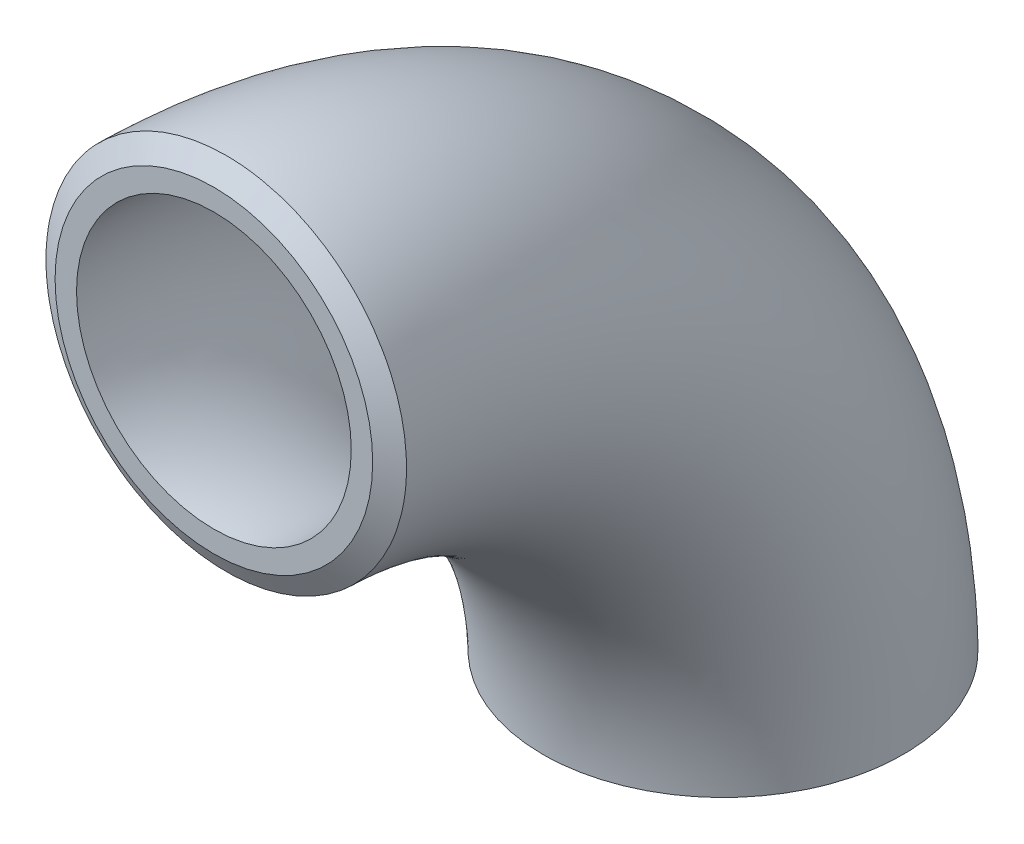
ISO-10303-21;
HEADER;
FILE_DESCRIPTION(('STEP AP214'),'2;1');
FILE_NAME('part.step','',(''),(''),'','','');
FILE_SCHEMA(('AUTOMOTIVE_DESIGN { 1 0 10303 214 1 1 1 1 }'));
ENDSEC;
DATA;
#1=APPLICATION_CONTEXT('core data for automotive mechanical design processes');
#2=APPLICATION_PROTOCOL_DEFINITION('international standard','automotive_design',2000,#1);
#3=PRODUCT_CONTEXT('',#1,'mechanical');
#4=PRODUCT('Part','Part','',(#3));
#5=PRODUCT_RELATED_PRODUCT_CATEGORY('part','',(#4));
#6=PRODUCT_DEFINITION_FORMATION('','',#4);
#7=PRODUCT_DEFINITION_CONTEXT('part definition',#1,'design');
#8=PRODUCT_DEFINITION('design','',#6,#7);
#9=PRODUCT_DEFINITION_SHAPE('','',#8);
#10=(LENGTH_UNIT() NAMED_UNIT(*) SI_UNIT(.MILLI.,.METRE.));
#11=(NAMED_UNIT(*) PLANE_ANGLE_UNIT() SI_UNIT($,.RADIAN.));
#12=(NAMED_UNIT(*) SI_UNIT($,.STERADIAN.) SOLID_ANGLE_UNIT());
#13=UNCERTAINTY_MEASURE_WITH_UNIT(LENGTH_MEASURE(1.E-05),#10,'distance_accuracy_value','');
#14=(GEOMETRIC_REPRESENTATION_CONTEXT(3) GLOBAL_UNCERTAINTY_ASSIGNED_CONTEXT((#13)) GLOBAL_UNIT_ASSIGNED_CONTEXT((#10,
#11,#12)) REPRESENTATION_CONTEXT('',''));
#15=CARTESIAN_POINT('',(0.,0.,0.));
#16=DIRECTION('',(0.,0.,1.));
#17=DIRECTION('',(1.,0.,0.));
#18=AXIS2_PLACEMENT_3D('',#15,#16,#17);
#19=CARTESIAN_POINT('',(0.,-37.9999999999999,38.));
#20=DIRECTION('',(-1.,0.,0.));
#21=DIRECTION('',(0.,0.,1.));
#22=AXIS2_PLACEMENT_3D('',#19,#20,#21);
#23=TOROIDAL_SURFACE('',#22,38.,13.45);
#24=CARTESIAN_POINT('',(-7.86908673137701,-37.0802883916331,-10.8991458283486));
#25=CARTESIAN_POINT('',(-7.56267222060092,-37.0803516405209,-11.1202426291125));
#26=CARTESIAN_POINT('',(-7.24696974580301,-37.080410306503,-11.3283909780312));
#27=CARTESIAN_POINT('',(-6.59905950936395,-37.0805187365004,-11.7174392163646));
#28=CARTESIAN_POINT('',(-6.26684743213186,-37.0805684981722,-11.8983319308348));
#29=CARTESIAN_POINT('',(-5.58801111136212,-37.0806593456447,-12.2316766987165));
#30=CARTESIAN_POINT('',(-5.24137175279116,-37.0807004220577,-12.3840979570246));
#31=CARTESIAN_POINT('',(-4.53647822149977,-37.0807740032925,-12.6591780432353));
#32=CARTESIAN_POINT('',(-4.17822409170243,-37.0808065081462,-12.781836981112));
#33=CARTESIAN_POINT('',(-3.45282963039835,-37.0808630697678,-12.9964652817127));
#34=CARTESIAN_POINT('',(-3.08569374473346,-37.0808871306726,-13.0884496713643));
#35=CARTESIAN_POINT('',(-2.3449710874531,-37.080926930079,-13.2411586129159));
#36=CARTESIAN_POINT('',(-1.97138421414243,-37.0809426684494,-13.3018826715534));
#37=CARTESIAN_POINT('',(-1.22051816591063,-37.0809658872765,-13.3916250034741));
#38=CARTESIAN_POINT('',(-0.843239955556095,-37.0809733698354,-13.4206513474822));
#39=CARTESIAN_POINT('',(-0.0875808522475655,-37.0809801167089,-13.4468193394818));
#40=CARTESIAN_POINT('',(0.290800036335401,-37.0809793810561,-13.4439611136927));
#41=CARTESIAN_POINT('',(1.04598872770263,-37.0809696882186,-13.4063799579004));
#42=CARTESIAN_POINT('',(1.42279647759787,-37.0809607307597,-13.3716559650974));
#43=CARTESIAN_POINT('',(2.17214775475778,-37.080934555018,-13.2705887706351));
#44=CARTESIAN_POINT('',(2.54469127794532,-37.0809173367273,-13.2042455387464));
#45=CARTESIAN_POINT('',(3.28287962373348,-37.0808745641676,-13.0404086601771));
#46=CARTESIAN_POINT('',(3.64852417925775,-37.0808490095766,-12.9429138101489));
#47=CARTESIAN_POINT('',(4.37030031147761,-37.0807894553659,-12.7174680994377));
#48=CARTESIAN_POINT('',(4.72643188979438,-37.0807554557478,-12.589517243945));
#49=CARTESIAN_POINT('',(5.42664717514046,-37.0806788685714,-12.3040711489412));
#50=CARTESIAN_POINT('',(5.77073099827971,-37.080636281096,-12.1465761942537));
#51=CARTESIAN_POINT('',(6.44440873399204,-37.0805423419659,-11.8031614390185));
#52=CARTESIAN_POINT('',(6.7740026464939,-37.0804909903111,-11.6172416383311));
#53=CARTESIAN_POINT('',(7.41635758872803,-37.0803793159587,-11.2183000075965));
#54=CARTESIAN_POINT('',(7.72911864995968,-37.0803189932779,-11.0052782282678));
#55=CARTESIAN_POINT('',(8.33558617170761,-37.0801891414341,-10.5536474345621));
#56=CARTESIAN_POINT('',(8.62929263080636,-37.0801196122703,-10.3150384182816));
#57=CARTESIAN_POINT('',(9.19559044913857,-37.0799710802941,-9.81390689466089));
#58=CARTESIAN_POINT('',(9.46817985810454,-37.0798920766083,-9.55138218344443));
#59=CARTESIAN_POINT('',(9.99027699170447,-37.0797243199957,-9.00430506373329));
#60=CARTESIAN_POINT('',(10.2397847155086,-37.0796355670685,-8.71975265444663));
#61=CARTESIAN_POINT('',(10.713946046081,-37.0794480172114,-8.13064399245107));
#62=CARTESIAN_POINT('',(10.9385996868495,-37.0793492202952,-7.82608776710822));
#63=CARTESIAN_POINT('',(11.3614581598319,-37.0791412812924,-7.199136477153));
#64=CARTESIAN_POINT('',(11.5596629888312,-37.0790321392046,-6.87674141037259));
#65=CARTESIAN_POINT('',(11.9282483243684,-37.0788031935189,-6.2163481728365));
#66=CARTESIAN_POINT('',(12.0986241022253,-37.0786833881145,-5.87834736285995));
#67=CARTESIAN_POINT('',(12.4103014167188,-37.078432851947,-5.18919659257526));
#68=CARTESIAN_POINT('',(12.5516029507345,-37.078302121183,-4.83804663108179));
#69=CARTESIAN_POINT('',(12.8041297604332,-37.0780294883546,-4.1250930681148));
#70=CARTESIAN_POINT('',(12.9153549806742,-37.0778875862696,-3.7632894470039));
#71=CARTESIAN_POINT('',(13.1069405161005,-37.0775924199649,-3.03160056264334));
#72=CARTESIAN_POINT('',(13.1873008263659,-37.0774391557433,-2.66171529810545));
#73=CARTESIAN_POINT('',(13.316602762039,-37.0771211168941,-1.916404238225));
#74=CARTESIAN_POINT('',(13.3655370354665,-37.076956339583,-1.54097716740114));
#75=CARTESIAN_POINT('',(13.4316113006197,-37.0766153059168,-0.787335549266699));
#76=CARTESIAN_POINT('',(13.4487512878454,-37.0764390495601,-0.409121001561603));
#77=CARTESIAN_POINT('',(13.4511171011533,-37.0760752041673,0.347408135516414));
#78=CARTESIAN_POINT('',(13.4363429032966,-37.0758876151227,0.725722724964163));
#79=CARTESIAN_POINT('',(13.3749870108707,-37.0755014401259,1.4797637266746));
#80=CARTESIAN_POINT('',(13.3284053112842,-37.0753028541719,1.85549013852902));
#81=CARTESIAN_POINT('',(13.2037511166881,-37.074895206743,2.60177938478982));
#82=CARTESIAN_POINT('',(13.1256707141873,-37.0746861426492,2.97234089840641));
#83=CARTESIAN_POINT('',(12.938574969677,-37.0742584477428,3.70557037147345));
#84=CARTESIAN_POINT('',(12.8295596220444,-37.0740398169284,4.06823832948903));
#85=CARTESIAN_POINT('',(12.5813691773624,-37.0735941964013,4.78310381423711));
#86=CARTESIAN_POINT('',(12.4421940367404,-37.0733672066765,5.13530132584187));
#87=CARTESIAN_POINT('',(12.1346732328789,-37.0729064774524,5.8267222953909));
#88=CARTESIAN_POINT('',(11.966327567661,-37.0726727379526,6.16594575245527));
#89=CARTESIAN_POINT('',(11.6016336326583,-37.0722005333298,6.8290581369956));
#90=CARTESIAN_POINT('',(11.4052810835846,-37.0719620674894,7.15294471099322));
#91=CARTESIAN_POINT('',(10.9859874667181,-37.071482997959,7.78302434481065));
#92=CARTESIAN_POINT('',(10.7630463947583,-37.0712423942687,8.08921740185748));
#93=CARTESIAN_POINT('',(10.2921590066079,-37.0707621156992,8.68173146653809));
#94=CARTESIAN_POINT('',(10.044212679526,-37.0705224408204,8.96805246551626));
#95=CARTESIAN_POINT('',(9.52507580938247,-37.0700475949158,9.51878380599648));
#96=CARTESIAN_POINT('',(9.25388527010182,-37.0698124238894,9.7831941510626));
#97=CARTESIAN_POINT('',(8.69022329757352,-37.0693506572138,10.2881871568451));
#98=CARTESIAN_POINT('',(8.39775466630488,-37.0691240604414,10.5287729450523));
#99=CARTESIAN_POINT('',(7.79358245443014,-37.0686838288761,10.9844411003647));
#100=CARTESIAN_POINT('',(7.48187887415152,-37.0684701940829,11.1995234679041));
#101=CARTESIAN_POINT('',(6.84145244928149,-37.0680605497138,11.6026493099625));
#102=CARTESIAN_POINT('',(6.5127296405806,-37.0678645401007,11.7906928414985));
#103=CARTESIAN_POINT('',(5.84060137860462,-37.0674948662427,12.1383978813976));
#104=CARTESIAN_POINT('',(5.49719593185231,-37.0673212019878,12.2980594023693));
#105=CARTESIAN_POINT('',(4.79833069768548,-37.0670008537097,12.5877814748535));
#106=CARTESIAN_POINT('',(4.44287739346882,-37.0668541554402,12.7178576651361));
#107=CARTESIAN_POINT('',(3.7222716920432,-37.0665917428363,12.9475865549878));
#108=CARTESIAN_POINT('',(3.35711929798699,-37.066476028492,13.0472392644462));
#109=CARTESIAN_POINT('',(2.61971491929096,-37.0662790160264,13.2154071448176));
#110=CARTESIAN_POINT('',(2.24746296273972,-37.0661977177691,13.2839224388956));
#111=CARTESIAN_POINT('',(1.49850794389047,-37.0660720473308,13.3893249116116));
#112=CARTESIAN_POINT('',(1.12180488344385,-37.0660276751345,13.4262121034046));
#113=CARTESIAN_POINT('',(0.366875765371443,-37.0659772783311,13.468080243798));
#114=CARTESIAN_POINT('',(-0.0113491425895085,-37.065971228806,13.4730819247294));
#115=CARTESIAN_POINT('',(-0.766875235469302,-37.0659976042673,13.451198343904));
#116=CARTESIAN_POINT('',(-1.14417642082386,-37.0660300292355,13.4243130971909));
#117=CARTESIAN_POINT('',(-1.8951715274677,-37.0661323231423,13.3388483107193));
#118=CARTESIAN_POINT('',(-2.2688654515939,-37.0662021920516,13.2802687958885));
#119=CARTESIAN_POINT('',(-3.00998945099571,-37.0663771983911,13.1318349386586));
#120=CARTESIAN_POINT('',(-3.37741952577473,-37.0664823358242,13.04198059378));
#121=CARTESIAN_POINT('',(-4.10335069402195,-37.0667247021461,12.8316555831075));
#122=CARTESIAN_POINT('',(-4.46185310164303,-37.0668619262804,12.7111894529704));
#123=CARTESIAN_POINT('',(-5.1674396590073,-37.0671645555077,12.4404952014617));
#124=CARTESIAN_POINT('',(-5.51452381089586,-37.0673299605955,12.2902670856823));
#125=CARTESIAN_POINT('',(-6.19481119738636,-37.0676845262867,11.9611209289147));
#126=CARTESIAN_POINT('',(-6.52801441792629,-37.0678736869141,11.7822028588633));
#127=CARTESIAN_POINT('',(-7.17817655511365,-37.0682710895813,11.3969523476805));
#128=CARTESIAN_POINT('',(-7.49513546388967,-37.0684793316303,11.1906198932652));
#129=CARTESIAN_POINT('',(-8.11072188351018,-37.0689103240595,10.7518959828766));
#130=CARTESIAN_POINT('',(-8.40933980356792,-37.069133081907,10.5194910697501));
#131=CARTESIAN_POINT('',(-8.9859474573301,-37.0695885056472,10.0303638481044));
#132=CARTESIAN_POINT('',(-9.2639371853029,-37.0698211715427,9.77364153282861));
#133=CARTESIAN_POINT('',(-9.79731866333723,-37.0702922494021,9.23770443115395));
#134=CARTESIAN_POINT('',(-10.052710313092,-37.0705306613914,8.95848954492725));
#135=CARTESIAN_POINT('',(-10.5390838666624,-37.071009509393,8.37955278589869));
#136=CARTESIAN_POINT('',(-10.7700657608531,-37.071249945406,8.0798309050109));
#137=CARTESIAN_POINT('',(-11.2061215260592,-37.0717297705762,7.46181188041123));
#138=CARTESIAN_POINT('',(-11.4111787791137,-37.0719691589678,7.14350301141545));
#139=CARTESIAN_POINT('',(-11.7937572922935,-37.072444018671,6.49074644706934));
#140=CARTESIAN_POINT('',(-11.9712785404962,-37.0726794899807,6.15629874473126));
#141=CARTESIAN_POINT('',(-12.2975250887814,-37.0731443014419,5.47364009321718));
#142=CARTESIAN_POINT('',(-12.4462502873222,-37.0733736415718,5.12542909551374));
#143=CARTESIAN_POINT('',(-12.7138474484633,-37.0738244406105,4.41771909132199));
#144=CARTESIAN_POINT('',(-12.8327194092916,-37.074045899519,4.05822008416371));
#145=CARTESIAN_POINT('',(-13.0397973819512,-37.0744796722388,3.33037465929318));
#146=CARTESIAN_POINT('',(-13.1279938277208,-37.0746919831793,2.96202551991088));
#147=CARTESIAN_POINT('',(-13.2730413870088,-37.0751064175375,2.2192063723904));
#148=CARTESIAN_POINT('',(-13.3298924867174,-37.0753085409507,1.84473636155561));
#149=CARTESIAN_POINT('',(-13.4118421561056,-37.0757019312207,1.09235258254105));
#150=CARTESIAN_POINT('',(-13.4369419575273,-37.0758931984984,0.71443894852413));
#151=CARTESIAN_POINT('',(-13.455212944281,-37.0762644774491,-0.0421589997713479));
#152=CARTESIAN_POINT('',(-13.4483841660388,-37.076444489135,-0.420843313170191));
#153=CARTESIAN_POINT('',(-13.4028485806948,-37.0767930249526,-1.1762268152736));
#154=CARTESIAN_POINT('',(-13.3641471114175,-37.0769615510026,-1.55292632574918));
#155=CARTESIAN_POINT('',(-13.255145967509,-37.0772871064705,-2.30172721697367));
#156=CARTESIAN_POINT('',(-13.1848461690913,-37.0774441358433,-2.67382857970347));
#157=CARTESIAN_POINT('',(-13.0131242587698,-37.0777468148371,-3.41087923004467));
#158=CARTESIAN_POINT('',(-12.911694238885,-37.0778924615547,-3.77582667526347));
#159=CARTESIAN_POINT('',(-12.6784395752539,-37.0781724972628,-4.49586889948493));
#160=CARTESIAN_POINT('',(-12.5466154170267,-37.0783068864331,-4.8509638357711));
#161=CARTESIAN_POINT('',(-12.2534698086981,-37.0785646737734,-5.54886913428745));
#162=CARTESIAN_POINT('',(-12.0921408395519,-37.0786880691297,-5.89167633840144));
#163=CARTESIAN_POINT('',(-11.741155885407,-37.0789241017673,-6.56246867722824));
#164=CARTESIAN_POINT('',(-11.5514998056146,-37.0790367390125,-6.89045376233566));
#165=CARTESIAN_POINT('',(-11.1454229075772,-37.0792514349099,-7.52892520125407));
#166=CARTESIAN_POINT('',(-10.9290311249905,-37.0793535048207,-7.83943001460877));
#167=CARTESIAN_POINT('',(-10.4709413732988,-37.0795474731444,-8.4410148798826));
#168=CARTESIAN_POINT('',(-10.2292500807197,-37.0796393742277,-8.73210002360674));
#169=CARTESIAN_POINT('',(-9.6590392031148,-37.0798350095904,-9.36273531935572));
#170=CARTESIAN_POINT('',(-9.32388074527866,-37.0799359961527,-9.69631642618048));
#171=CARTESIAN_POINT('',(-8.62034442228301,-37.0801231708935,-10.3263860789111));
#172=CARTESIAN_POINT('',(-8.25196655911563,-37.080209359073,-10.6228746270415));
#173=CARTESIAN_POINT('',(-7.86908673137701,-37.0802883916331,-10.8991458283486));
#174=B_SPLINE_CURVE_WITH_KNOTS('',3,(#24,#25,#26,#27,#28,#29,#30,#31,#32,#33,#34,#35,#36,#37,
#38,#39,#40,#41,#42,#43,#44,#45,#46,#47,#48,#49,#50,#51,#52,#53,#54,#55,#56,#57,#58,#59,#60,#61,
#62,#63,#64,#65,#66,#67,#68,#69,#70,#71,#72,#73,#74,#75,#76,#77,#78,#79,#80,#81,#82,#83,#84,#85,
#86,#87,#88,#89,#90,#91,#92,#93,#94,#95,#96,#97,#98,#99,#100,#101,#102,#103,#104,#105,#106,#107,
#108,#109,#110,#111,#112,#113,#114,#115,#116,#117,#118,#119,#120,#121,#122,#123,#124,#125,#126,
#127,#128,#129,#130,#131,#132,#133,#134,#135,#136,#137,#138,#139,#140,#141,#142,#143,#144,#145,
#146,#147,#148,#149,#150,#151,#152,#153,#154,#155,#156,#157,#158,#159,#160,#161,#162,#163,#164,
#165,#166,#167,#168,#169,#170,#171,#172,#173),.UNSPECIFIED.,.T.,.F.,(4,2,2,2,2,2,2,2,2,2,2,2,2,
2,2,2,2,2,2,2,2,2,2,2,2,2,2,2,2,2,2,2,2,2,2,2,2,2,2,2,2,2,2,2,2,2,2,2,2,2,2,2,2,2,2,2,2,2,2,2,2,
2,2,2,2,2,2,2,2,2,2,2,2,2,4),(0.,1.13314965816054,2.26659709454202,3.40126347240422,
4.53592565751607,5.67003117199212,6.80415458118072,7.93798915775602,9.07181924589137,
10.2056871513564,11.3395561408509,12.4734689355652,13.6073815370379,14.7412832074457,
15.8751848834272,17.0090844374607,18.1429840758486,19.2769883111259,20.4109925871745,
21.5449953118905,22.6789981744271,23.813193525444,24.9473889787038,26.0815865227019,
27.2157842474917,28.3502472161756,29.4847103454241,30.6191743256378,31.753638484798,
32.8883876192903,34.0231369600551,35.1578879402318,36.2926389973675,37.4275636239646,
38.5624884284302,39.6974137272288,40.8323388414159,41.9671147739726,43.1018906872099,
44.2366642075042,45.3714372236795,46.5056089988801,47.6397804054159,48.7739473256641,
49.9081137741819,51.0415426991743,52.1749710894303,53.3083985882351,54.4418261768972,
55.5750859268039,56.7083454637813,57.8416061487731,58.9748673828969,60.1087162582133,
61.2425654485734,62.3764196715289,63.5102743415672,64.6448521781807,65.7794305060451,
66.9140128346289,68.0485952305518,69.1835311258146,70.3184675210947,71.4533598869422,
72.5882509580508,73.7229520038584,74.8576574948948,75.9926514730151,77.1276273218785,
78.262892813538,79.3981621043247,80.5322091258957,81.6659576240296,83.0818832955582,
84.4978088821752),.UNSPECIFIED.);
#175=CARTESIAN_POINT('',(-7.86908673137701,-37.0802883916331,-10.8991458283486));
#176=VERTEX_POINT('',#175);
#177=EDGE_CURVE('E44',#176,#176,#174,.T.);
#178=ORIENTED_EDGE('',*,*,#177,.F.);
#179=EDGE_LOOP('',(#178));
#180=FACE_BOUND('',#179,.T.);
#181=CARTESIAN_POINT('',(-8.00013578374069,-10.8279959817111,37.0688347828289));
#182=CARTESIAN_POINT('',(-8.30397373976956,-10.6030416222864,37.0690533251202));
#183=CARTESIAN_POINT('',(-8.59828667637923,-10.3652965529832,37.0692785495989));
#184=CARTESIAN_POINT('',(-9.16594745039335,-9.86579405251944,37.0697380525238));
#185=CARTESIAN_POINT('',(-9.43928972537054,-9.60403029060298,37.0699723333474));
#186=CARTESIAN_POINT('',(-9.96324201722131,-9.05812584523207,37.07044605385));
#187=CARTESIAN_POINT('',(-10.2138271234914,-8.77396126173946,37.0706854988355));
#188=CARTESIAN_POINT('',(-10.6901571028571,-8.1855240516606,37.0711656754494));
#189=CARTESIAN_POINT('',(-10.9159020578306,-7.88125149135936,37.0714064070737));
#190=CARTESIAN_POINT('',(-11.3408495442276,-7.25490812788526,37.0718859225085));
#191=CARTESIAN_POINT('',(-11.5400641503236,-6.93284551651849,37.0721247071584));
#192=CARTESIAN_POINT('',(-11.9106611079477,-6.27307960493663,37.0725978383311));
#193=CARTESIAN_POINT('',(-12.0820430187794,-5.93537605717543,37.0728321847836));
#194=CARTESIAN_POINT('',(-12.3957130326721,-5.24682188436043,37.0732942653591));
#195=CARTESIAN_POINT('',(-12.5380085713815,-4.89597464656906,37.0735220011592));
#196=CARTESIAN_POINT('',(-12.7925497375795,-4.18354525288308,37.0739692688241));
#197=CARTESIAN_POINT('',(-12.904795477881,-3.82196313729502,37.0741888007197));
#198=CARTESIAN_POINT('',(-13.0984764918098,-3.09049268753269,37.0746184954125));
#199=CARTESIAN_POINT('',(-13.1799000996774,-2.72060126439714,37.0748286546358));
#200=CARTESIAN_POINT('',(-13.3112970461737,-1.97527344816709,37.0752386183909));
#201=CARTESIAN_POINT('',(-13.3612703463585,-1.59983704829515,37.0754384229101));
#202=CARTESIAN_POINT('',(-13.4294111609246,-0.846073893786267,37.0758270831103));
#203=CARTESIAN_POINT('',(-13.447577418544,-0.467747025534128,37.0760159383583));
#204=CARTESIAN_POINT('',(-13.4519693807516,0.289092000500782,37.0763823325013));
#205=CARTESIAN_POINT('',(-13.4381950956857,0.667604158223496,37.0765598713999));
#206=CARTESIAN_POINT('',(-13.3788048495246,1.4220863042316,37.0769034521248));
#207=CARTESIAN_POINT('',(-13.3331918854937,1.79805652843318,37.0770694950317));
#208=CARTESIAN_POINT('',(-13.2104498367081,2.54481687619828,37.077390088926));
#209=CARTESIAN_POINT('',(-13.1333207515975,2.91560699970331,37.0775446399133));
#210=CARTESIAN_POINT('',(-12.9480932569199,3.64936843297378,37.0778423506914));
#211=CARTESIAN_POINT('',(-12.8399949354082,4.01233976496733,37.0779855105146));
#212=CARTESIAN_POINT('',(-12.5935958189807,4.72788213907832,37.0782606237106));
#213=CARTESIAN_POINT('',(-12.4552950295021,5.08045318306804,37.0783925770853));
#214=CARTESIAN_POINT('',(-12.1495084208391,5.77260578010034,37.0786454895536));
#215=CARTESIAN_POINT('',(-11.9820293666047,6.11219032184289,37.0787664511856));
#216=CARTESIAN_POINT('',(-11.619053649429,6.77604014823454,37.0789976918288));
#217=CARTESIAN_POINT('',(-11.4235569901869,7.10030543490625,37.0791079708415));
#218=CARTESIAN_POINT('',(-11.005935537632,7.73120852006188,37.0793181421744));
#219=CARTESIAN_POINT('',(-10.7838108175326,8.03784636700879,37.0794180345232));
#220=CARTESIAN_POINT('',(-10.3145114766917,8.63131322649678,37.0796077344725));
#221=CARTESIAN_POINT('',(-10.0673368597765,8.91814224206363,37.0796975420746));
#222=CARTESIAN_POINT('',(-9.54975912775337,9.46988143188904,37.0798673478475));
#223=CARTESIAN_POINT('',(-9.27936178175922,9.7347970180786,37.0799473484426));
#224=CARTESIAN_POINT('',(-8.71720785130619,10.2409035966543,37.0800978487617));
#225=CARTESIAN_POINT('',(-8.4254512701996,10.482094592764,37.0801683484871));
#226=CARTESIAN_POINT('',(-7.82265291748336,10.9390356843431,37.0803001099578));
#227=CARTESIAN_POINT('',(-7.51161114119699,11.1547857736431,37.0803613717009));
#228=CARTESIAN_POINT('',(-6.87245410713389,11.5593094757624,37.0804748954854));
#229=CARTESIAN_POINT('',(-6.54433885109855,11.7480830913332,37.0805271575279));
#230=CARTESIAN_POINT('',(-5.87343380844333,12.0972761121466,37.0806228827297));
#231=CARTESIAN_POINT('',(-5.53064689884708,12.2577010450396,37.0806663476046));
#232=CARTESIAN_POINT('',(-4.83277587597024,12.5491003707272,37.0807446705624));
#233=CARTESIAN_POINT('',(-4.47769176434112,12.6800747674769,37.0807795286466));
#234=CARTESIAN_POINT('',(-3.75775145622551,12.9116409110228,37.0808407846845));
#235=CARTESIAN_POINT('',(-3.39289526937297,13.012232687771,37.0808671826467));
#236=CARTESIAN_POINT('',(-2.65600493456406,13.1823179236238,37.0809116312213));
#237=CARTESIAN_POINT('',(-2.28397078697544,13.2518113843216,37.0809296818342));
#238=CARTESIAN_POINT('',(-1.53541462259321,13.3591990677158,37.0809575119417));
#239=CARTESIAN_POINT('',(-1.15889314335626,13.3970970375346,37.0809672924171));
#240=CARTESIAN_POINT('',(-0.403995991819984,13.441037968969,37.0809786283173));
#241=CARTESIAN_POINT('',(-0.025620319687193,13.4470809334457,37.0809801837427));
#242=CARTESIAN_POINT('',(0.730294925487052,13.4272688638671,37.080975076314));
#243=CARTESIAN_POINT('',(1.10783449867556,13.4014138354228,37.0809684134614));
#244=CARTESIAN_POINT('',(1.8593933413483,13.3179897496819,37.0809468405169));
#245=CARTESIAN_POINT('',(2.23341261083682,13.2604206924241,37.0809319304251));
#246=CARTESIAN_POINT('',(2.97525768206811,13.1139809121389,37.0808937992237));
#247=CARTESIAN_POINT('',(3.34308371648617,13.0251113678095,37.0808705784271));
#248=CARTESIAN_POINT('',(4.06994192887276,12.8167024514931,37.0808157261534));
#249=CARTESIAN_POINT('',(4.42897410720994,12.6971630807917,37.0807840946767));
#250=CARTESIAN_POINT('',(5.13569246108559,12.4282649069717,37.0807122871587));
#251=CARTESIAN_POINT('',(5.48337863749699,12.2789061061472,37.0806721111181));
#252=CARTESIAN_POINT('',(6.16493377891675,11.9514315170987,37.080583047418));
#253=CARTESIAN_POINT('',(6.49880274326544,11.7733157275018,37.0805341597581));
#254=CARTESIAN_POINT('',(7.15036502223819,11.3895856387694,37.0804274719175));
#255=CARTESIAN_POINT('',(7.4680576248735,11.1839701306995,37.080369671345));
#256=CARTESIAN_POINT('',(8.08499373640114,10.7467091588228,37.0802449314722));
#257=CARTESIAN_POINT('',(8.3842372451553,10.5150636948212,37.080177992172));
#258=CARTESIAN_POINT('',(8.96214906094852,10.0273902371857,37.0800347210324));
#259=CARTESIAN_POINT('',(9.24081736174428,9.77136223615335,37.0799583891903));
#260=CARTESIAN_POINT('',(9.77559907257437,9.23674445694152,37.079796057448));
#261=CARTESIAN_POINT('',(10.0317124804328,8.95815467658555,37.079710057547));
#262=CARTESIAN_POINT('',(10.5195959761988,8.38035807214832,37.0795280867048));
#263=CARTESIAN_POINT('',(10.7513630160606,8.08114867433918,37.0794321145181));
#264=CARTESIAN_POINT('',(11.1888711811016,7.46427155707381,37.0792299076701));
#265=CARTESIAN_POINT('',(11.3946123047586,7.14660383653807,37.0791236730081));
#266=CARTESIAN_POINT('',(11.7786080908743,6.49506853851091,37.0789006418508));
#267=CARTESIAN_POINT('',(11.9568627409256,6.16120095370695,37.0787838453507));
#268=CARTESIAN_POINT('',(12.2846205142823,5.47963942380954,37.0785394046096));
#269=CARTESIAN_POINT('',(12.4341236335509,5.13194547677478,37.0784117603671));
#270=CARTESIAN_POINT('',(12.7033449039399,4.42513165106384,37.0781453404776));
#271=CARTESIAN_POINT('',(12.8230570872879,4.06600949929434,37.0780065626076));
#272=CARTESIAN_POINT('',(13.0318087487434,3.33895846132081,37.0777176890229));
#273=CARTESIAN_POINT('',(13.1208482234089,2.97102957412854,37.077567593307));
#274=CARTESIAN_POINT('',(13.2676238690758,2.2289796130412,37.0772559475916));
#275=CARTESIAN_POINT('',(13.3253599976745,1.85485853075909,37.0770943975767));
#276=CARTESIAN_POINT('',(13.4091205805346,1.10308317210426,37.0767598087291));
#277=CARTESIAN_POINT('',(13.4351450295272,0.725428895144513,37.0765867698946));
#278=CARTESIAN_POINT('',(13.455301828905,-0.0308246123539651,37.076229260024));
#279=CARTESIAN_POINT('',(13.4494261800932,-0.409424056109196,37.076044786132));
#280=CARTESIAN_POINT('',(13.4058077985424,-1.16478275142418,37.0756647236993));
#281=CARTESIAN_POINT('',(13.3680650606344,-1.54154200268542,37.0754691351567));
#282=CARTESIAN_POINT('',(13.2609822361228,-2.29054316318169,37.0750673450202));
#283=CARTESIAN_POINT('',(13.1916421425762,-2.66278507142407,37.0748611434238));
#284=CARTESIAN_POINT('',(13.0218584957763,-3.40010665993143,37.0744389034463));
#285=CARTESIAN_POINT('',(12.9214149384014,-3.7651863392473,37.0742228650637));
#286=CARTESIAN_POINT('',(12.6901124102079,-4.48567170561823,37.0737820070395));
#287=CARTESIAN_POINT('',(12.5592465236828,-4.84107517249179,37.0735571854108));
#288=CARTESIAN_POINT('',(12.2680422225595,-5.53959542899921,37.0731002991454));
#289=CARTESIAN_POINT('',(12.1077038025198,-5.8827122163646,37.0728682345073));
#290=CARTESIAN_POINT('',(11.7586932250317,-6.5542208797425,37.0723987918646));
#291=CARTESIAN_POINT('',(11.5700209838606,-6.88261271224098,37.0721614138442));
#292=CARTESIAN_POINT('',(11.165683254308,-7.52233528881293,37.0716837575076));
#293=CARTESIAN_POINT('',(10.9500177662862,-7.83366603311373,37.0714434791914));
#294=CARTESIAN_POINT('',(10.4932128965702,-8.43706792523745,37.0709629316239));
#295=CARTESIAN_POINT('',(10.2520721587986,-8.72913804644927,37.0707226623737));
#296=CARTESIAN_POINT('',(9.7460387535911,-9.29192164792237,37.0702455813021));
#297=CARTESIAN_POINT('',(9.48114608364528,-9.56263512592678,37.0700087694809));
#298=CARTESIAN_POINT('',(8.92948979203384,-10.0807775355006,37.0695425206037));
#299=CARTESIAN_POINT('',(8.64272613627288,-10.3282064307696,37.0693130835592));
#300=CARTESIAN_POINT('',(8.04936551145214,-10.798015173763,37.0688659111338));
#301=CARTESIAN_POINT('',(7.74276854857544,-11.0203950292965,37.0686481757494));
#302=CARTESIAN_POINT('',(7.11201040535304,-11.438458983719,37.0682290797125));
#303=CARTESIAN_POINT('',(6.78785426736607,-11.6341506902898,37.0680277144003));
#304=CARTESIAN_POINT('',(6.12420118808784,-11.9975160356085,37.0676460127554));
#305=CARTESIAN_POINT('',(5.78470424599973,-12.165189672901,37.0674656764238));
#306=CARTESIAN_POINT('',(5.09279826838266,-12.4713136387367,37.0671306601036));
#307=CARTESIAN_POINT('',(4.74038977920135,-12.6097652021295,37.066975979031));
#308=CARTESIAN_POINT('',(4.02515474238639,-12.8564628948498,37.0666965306512));
#309=CARTESIAN_POINT('',(3.66232821047456,-12.9647090697574,37.0665717632989));
#310=CARTESIAN_POINT('',(2.92911596897539,-13.1501507614579,37.0663558751327));
#311=CARTESIAN_POINT('',(2.55873615866204,-13.2273696036874,37.0662647290475));
#312=CARTESIAN_POINT('',(1.81278527651216,-13.3503205478871,37.0661187360161));
#313=CARTESIAN_POINT('',(1.43721418659198,-13.3960525401458,37.0660638891965));
#314=CARTESIAN_POINT('',(0.683458915693607,-13.4557091154203,37.0659922122467));
#315=CARTESIAN_POINT('',(0.305274100320389,-13.4696256833961,37.0659753916963));
#316=CARTESIAN_POINT('',(-0.450916314519459,-13.4655281616752,37.0659803326076));
#317=CARTESIAN_POINT('',(-0.828921916764258,-13.447514584304,37.0660020934503));
#318=CARTESIAN_POINT('',(-1.5820613428217,-13.3796873984859,37.0660835010451));
#319=CARTESIAN_POINT('',(-1.95719522871082,-13.3298744794053,37.0661431469758));
#320=CARTESIAN_POINT('',(-2.70192932293057,-13.1988071274398,37.0662984508972));
#321=CARTESIAN_POINT('',(-3.07152951078708,-13.1175525782541,37.066394109021));
#322=CARTESIAN_POINT('',(-3.80217894253809,-12.9242840124428,37.0666184109933));
#323=CARTESIAN_POINT('',(-4.16323695177227,-12.8123031569188,37.0667470192707));
#324=CARTESIAN_POINT('',(-4.8745316294748,-12.5583926805509,37.0670334901284));
#325=CARTESIAN_POINT('',(-5.22477111753896,-12.4164709399054,37.0671913450098));
#326=CARTESIAN_POINT('',(-5.99728672299544,-12.0648626560242,37.0675743000516));
#327=CARTESIAN_POINT('',(-6.41591341457092,-11.8470985175161,37.0678063712192));
#328=CARTESIAN_POINT('',(-7.22800350135892,-11.3688438656441,37.0683004295545));
#329=CARTESIAN_POINT('',(-7.6214669053664,-11.1083533672139,37.0685624167117));
#330=CARTESIAN_POINT('',(-8.00013578374069,-10.8279959817111,37.0688347828289));
#331=B_SPLINE_CURVE_WITH_KNOTS('',3,(#181,#182,#183,#184,#185,#186,#187,#188,#189,#190,#191,
#192,#193,#194,#195,#196,#197,#198,#199,#200,#201,#202,#203,#204,#205,#206,#207,#208,#209,#210,
#211,#212,#213,#214,#215,#216,#217,#218,#219,#220,#221,#222,#223,#224,#225,#226,#227,#228,#229,
#230,#231,#232,#233,#234,#235,#236,#237,#238,#239,#240,#241,#242,#243,#244,#245,#246,#247,#248,
#249,#250,#251,#252,#253,#254,#255,#256,#257,#258,#259,#260,#261,#262,#263,#264,#265,#266,#267,
#268,#269,#270,#271,#272,#273,#274,#275,#276,#277,#278,#279,#280,#281,#282,#283,#284,#285,#286,
#287,#288,#289,#290,#291,#292,#293,#294,#295,#296,#297,#298,#299,#300,#301,#302,#303,#304,#305,
#306,#307,#308,#309,#310,#311,#312,#313,#314,#315,#316,#317,#318,#319,#320,#321,#322,#323,#324,
#325,#326,#327,#328,#329,#330),.UNSPECIFIED.,.T.,.F.,(4,2,2,2,2,2,2,2,2,2,2,2,2,2,2,2,2,2,2,2,2,
2,2,2,2,2,2,2,2,2,2,2,2,2,2,2,2,2,2,2,2,2,2,2,2,2,2,2,2,2,2,2,2,2,2,2,2,2,2,2,2,2,2,2,2,2,2,2,2,
2,2,2,2,2,4),(0.,1.13373904016551,2.26777777009769,3.40304325239461,4.53830499252841,
5.67304826585082,6.80780950468035,7.94228028902596,9.0767468142807,10.2116422914529,
11.346539155887,12.4814808614271,13.6164221993433,14.7512567164494,15.88609124637,
17.0209225496342,18.1557536486024,19.2903219874661,20.4248901765323,21.5594552461895,
22.6940201425426,23.8283039950581,24.9625876695505,26.0968716191106,27.2311554529797,
28.3652178705772,29.4992801358758,30.6333412831823,31.7674023723885,32.9013289464979,
34.0352554187671,35.169181691578,36.3031079630056,37.4369915381716,38.5708750658041,
39.7047585062001,40.8386420007306,41.9725753591109,43.1065087259844,44.2404424369358,
45.3743762572767,46.508451871794,47.6425275526365,48.7766037454003,49.9106800973961,
51.0449834470053,52.1792869238995,53.3135919372825,54.4478971391272,55.5824867899391,
56.7170766247926,57.8516667089556,58.9862569434663,60.1211053494978,61.2559539650539,
62.3908059340047,63.5256578878338,64.6605702816343,65.7954827953664,66.9303970783834,
68.0653110075892,69.1999007407652,70.3344905328747,71.4690323705318,72.6035724961484,
73.7372581048753,74.870947663752,76.0049227937526,77.1388797290644,78.2728120825766,
79.4067486304842,80.53946616822,81.6718859549635,83.0848491224747,84.4978117961304),.UNSPECIFIED.);
#332=CARTESIAN_POINT('',(-8.00013578374069,-10.8279959817111,37.0688347828289));
#333=VERTEX_POINT('',#332);
#334=EDGE_CURVE('E82',#333,#333,#331,.T.);
#335=ORIENTED_EDGE('',*,*,#334,.T.);
#336=EDGE_LOOP('',(#335));
#337=FACE_BOUND('',#336,.T.);
#338=ADVANCED_FACE('F33',(#180,#337),#23,.T.);
#339=CARTESIAN_POINT('',(0.,1.26311407455962E-13,37.9999999999999));
#340=DIRECTION('',(0.,0.,-1.));
#341=DIRECTION('',(0.,1.,0.));
#342=AXIS2_PLACEMENT_3D('',#339,#340,#341);
#343=PLANE('',#342);
#344=CARTESIAN_POINT('',(0.,1.26311407455962E-13,37.9999999999999));
#345=DIRECTION('',(0.,0.,-1.));
#346=DIRECTION('',(0.,1.,0.));
#347=AXIS2_PLACEMENT_3D('',#344,#345,#346);
#348=CIRCLE('',#347,10.25);
#349=CARTESIAN_POINT('',(0.,10.2500000000001,37.9999999999998));
#350=VERTEX_POINT('',#349);
#351=EDGE_CURVE('E10',#350,#350,#348,.T.);
#352=ORIENTED_EDGE('',*,*,#351,.T.);
#353=EDGE_LOOP('',(#352));
#354=FACE_BOUND('',#353,.T.);
#355=CARTESIAN_POINT('',(0.,1.24936702450045E-13,37.9999999999999));
#356=DIRECTION('',(0.,0.,-1.));
#357=DIRECTION('',(0.,1.,0.));
#358=AXIS2_PLACEMENT_3D('',#355,#356,#357);
#359=CIRCLE('',#358,11.85);
#360=CARTESIAN_POINT('',(0.,11.8500000000001,37.9999999999999));
#361=VERTEX_POINT('',#360);
#362=EDGE_CURVE('E84',#361,#361,#359,.T.);
#363=ORIENTED_EDGE('',*,*,#362,.F.);
#364=EDGE_LOOP('',(#363));
#365=FACE_BOUND('',#364,.T.);
#366=ADVANCED_FACE('F68',(#354,#365),#343,.F.);
#367=CARTESIAN_POINT('',(0.,-37.9999999999999,38.));
#368=DIRECTION('',(-1.,0.,0.));
#369=DIRECTION('',(0.,0.,1.));
#370=AXIS2_PLACEMENT_3D('',#367,#368,#369);
#371=TOROIDAL_SURFACE('',#370,38.,10.25);
#372=CARTESIAN_POINT('',(0.,-37.9999999999999,0.));
#373=DIRECTION('',(0.,-1.,0.));
#374=DIRECTION('',(0.,0.,-1.));
#375=AXIS2_PLACEMENT_3D('',#372,#373,#374);
#376=CIRCLE('',#375,10.25);
#377=CARTESIAN_POINT('',(0.,-37.9999999999999,-10.25));
#378=VERTEX_POINT('',#377);
#379=EDGE_CURVE('E40',#378,#378,#376,.T.);
#380=CARTESIAN_POINT('',(0.,-37.9999999999999,38.));
#381=DIRECTION('',(-1.,0.,0.));
#382=DIRECTION('',(0.,0.,1.));
#383=AXIS2_PLACEMENT_3D('',#380,#381,#382);
#384=CIRCLE('',#383,48.25);
#385=EDGE_CURVE('',#350,#378,#384,.T.);
#386=ORIENTED_EDGE('',*,*,#351,.F.);
#387=ORIENTED_EDGE('',*,*,#379,.T.);
#388=ORIENTED_EDGE('',*,*,#385,.T.);
#389=ORIENTED_EDGE('',*,*,#385,.F.);
#390=EDGE_LOOP('',(#386,#388,#387,#389));
#391=FACE_BOUND('',#390,.T.);
#392=ADVANCED_FACE('F66',(#391),#371,.F.);
#393=CARTESIAN_POINT('',(0.,-37.9999999999999,0.));
#394=DIRECTION('',(0.,-1.,0.));
#395=DIRECTION('',(0.,0.,-1.));
#396=AXIS2_PLACEMENT_3D('',#393,#394,#395);
#397=PLANE('',#396);
#398=CARTESIAN_POINT('',(0.,-37.9999999999998,0.));
#399=DIRECTION('',(0.,1.,0.));
#400=DIRECTION('',(0.,0.,1.));
#401=AXIS2_PLACEMENT_3D('',#398,#399,#400);
#402=CIRCLE('',#401,11.85);
#403=CARTESIAN_POINT('',(0.,-37.9999999999998,11.85));
#404=VERTEX_POINT('',#403);
#405=EDGE_CURVE('E48',#404,#404,#402,.T.);
#406=ORIENTED_EDGE('',*,*,#405,.F.);
#407=EDGE_LOOP('',(#406));
#408=FACE_BOUND('',#407,.T.);
#409=ORIENTED_EDGE('',*,*,#379,.F.);
#410=EDGE_LOOP('',(#409));
#411=FACE_BOUND('',#410,.T.);
#412=ADVANCED_FACE('F61',(#408,#411),#397,.T.);
#413=CARTESIAN_POINT('',(0.,-37.9999999999998,0.));
#414=DIRECTION('',(0.,1.,0.));
#415=DIRECTION('',(0.,0.,1.));
#416=AXIS2_PLACEMENT_3D('',#413,#414,#415);
#417=CONICAL_SURFACE('',#416,11.85,1.0471975511966);
#418=ORIENTED_EDGE('',*,*,#177,.T.);
#419=EDGE_LOOP('',(#418));
#420=FACE_BOUND('',#419,.T.);
#421=ORIENTED_EDGE('',*,*,#405,.T.);
#422=EDGE_LOOP('',(#421));
#423=FACE_BOUND('',#422,.T.);
#424=ADVANCED_FACE('F55',(#420,#423),#417,.T.);
#425=CARTESIAN_POINT('',(0.,1.18103121932984E-13,35.9215390309173));
#426=DIRECTION('',(0.,0.,-1.));
#427=DIRECTION('',(0.,1.,0.));
#428=AXIS2_PLACEMENT_3D('',#425,#426,#427);
#429=CONICAL_SURFACE('',#428,15.45,1.04719755119661);
#430=ORIENTED_EDGE('',*,*,#334,.F.);
#431=EDGE_LOOP('',(#430));
#432=FACE_BOUND('',#431,.T.);
#433=ORIENTED_EDGE('',*,*,#362,.T.);
#434=EDGE_LOOP('',(#433));
#435=FACE_BOUND('',#434,.T.);
#436=ADVANCED_FACE('F60',(#432,#435),#429,.T.);
#437=CLOSED_SHELL('',(#338,#366,#392,#412,#424,#436));
#438=MANIFOLD_SOLID_BREP('B2',#437);
#439=ADVANCED_BREP_SHAPE_REPRESENTATION('',(#18,#438),#14);
#440=SHAPE_DEFINITION_REPRESENTATION(#9,#439);
ENDSEC;
END-ISO-10303-21;
